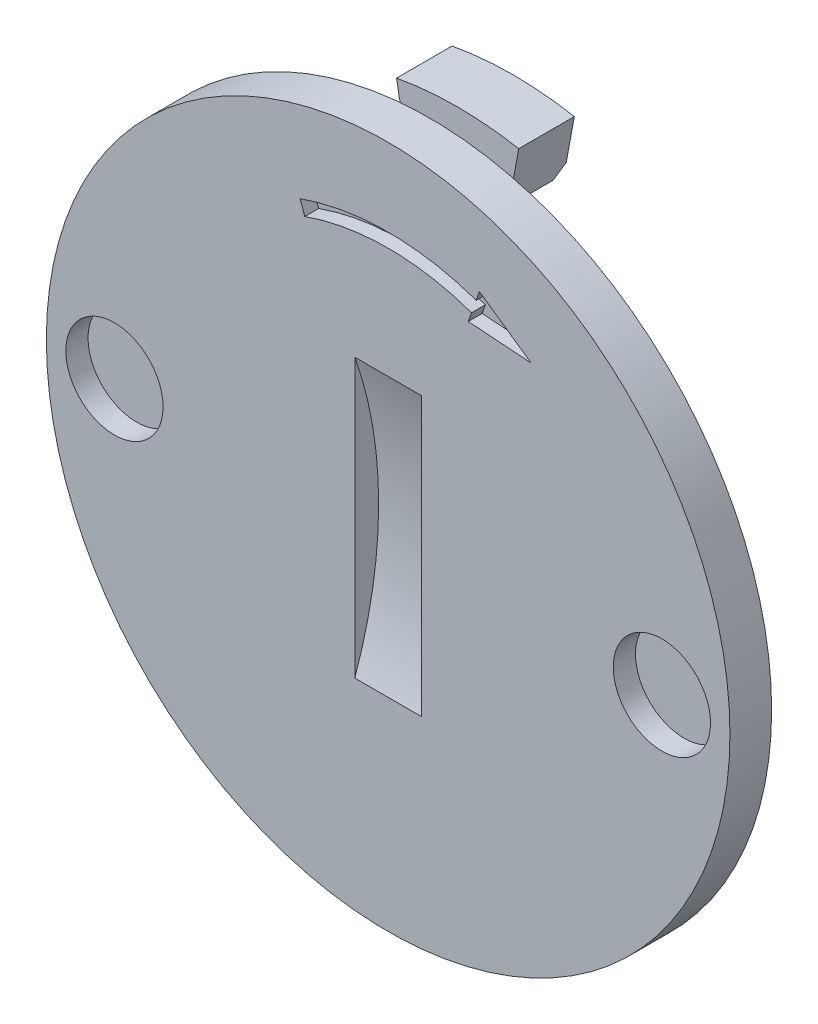
ISO-10303-21;
HEADER;
FILE_DESCRIPTION(('STEP AP214'),'2;1');
FILE_NAME('part.step','',(''),(''),'','','');
FILE_SCHEMA(('AUTOMOTIVE_DESIGN { 1 0 10303 214 1 1 1 1 }'));
ENDSEC;
DATA;
#1=APPLICATION_CONTEXT('core data for automotive mechanical design processes');
#2=APPLICATION_PROTOCOL_DEFINITION('international standard','automotive_design',2000,#1);
#3=PRODUCT_CONTEXT('',#1,'mechanical');
#4=PRODUCT('Part','Part','',(#3));
#5=PRODUCT_RELATED_PRODUCT_CATEGORY('part','',(#4));
#6=PRODUCT_DEFINITION_FORMATION('','',#4);
#7=PRODUCT_DEFINITION_CONTEXT('part definition',#1,'design');
#8=PRODUCT_DEFINITION('design','',#6,#7);
#9=PRODUCT_DEFINITION_SHAPE('','',#8);
#10=(LENGTH_UNIT() NAMED_UNIT(*) SI_UNIT(.MILLI.,.METRE.));
#11=(NAMED_UNIT(*) PLANE_ANGLE_UNIT() SI_UNIT($,.RADIAN.));
#12=(NAMED_UNIT(*) SI_UNIT($,.STERADIAN.) SOLID_ANGLE_UNIT());
#13=UNCERTAINTY_MEASURE_WITH_UNIT(LENGTH_MEASURE(1.E-05),#10,'distance_accuracy_value','');
#14=(GEOMETRIC_REPRESENTATION_CONTEXT(3) GLOBAL_UNCERTAINTY_ASSIGNED_CONTEXT((#13)) GLOBAL_UNIT_ASSIGNED_CONTEXT((#10,
#11,#12)) REPRESENTATION_CONTEXT('',''));
#15=CARTESIAN_POINT('',(0.,0.,0.));
#16=DIRECTION('',(0.,0.,1.));
#17=DIRECTION('',(1.,0.,0.));
#18=AXIS2_PLACEMENT_3D('',#15,#16,#17);
#19=CARTESIAN_POINT('',(0.,0.,-3.));
#20=DIRECTION('',(0.,0.,1.));
#21=DIRECTION('',(1.,0.,0.));
#22=AXIS2_PLACEMENT_3D('',#19,#20,#21);
#23=CYLINDRICAL_SURFACE('',#22,11.05);
#24=DIRECTION('',(0.,0.,1.));
#25=VECTOR('',#24,1.);
#26=CARTESIAN_POINT('',(-2.,-10.867497412008,-3.));
#27=LINE('',#26,#25);
#28=CARTESIAN_POINT('',(-2.,-10.867497412008,-1.));
#29=VERTEX_POINT('',#28);
#30=CARTESIAN_POINT('',(-2.,-10.867497412008,0.));
#31=VERTEX_POINT('',#30);
#32=EDGE_CURVE('E308',#29,#31,#27,.T.);
#33=ORIENTED_EDGE('',*,*,#32,.F.);
#34=CARTESIAN_POINT('',(0.,0.,-1.));
#35=DIRECTION('',(0.,0.,1.));
#36=DIRECTION('',(1.,0.,0.));
#37=AXIS2_PLACEMENT_3D('',#34,#35,#36);
#38=CIRCLE('',#37,11.05);
#39=CARTESIAN_POINT('',(2.,-10.867497412008,-1.));
#40=VERTEX_POINT('',#39);
#41=EDGE_CURVE('E255',#29,#40,#38,.T.);
#42=ORIENTED_EDGE('',*,*,#41,.T.);
#43=DIRECTION('',(0.,0.,1.));
#44=VECTOR('',#43,1.);
#45=CARTESIAN_POINT('',(2.,-10.867497412008,-3.));
#46=LINE('',#45,#44);
#47=CARTESIAN_POINT('',(2.,-10.867497412008,0.));
#48=VERTEX_POINT('',#47);
#49=EDGE_CURVE('E306',#40,#48,#46,.T.);
#50=ORIENTED_EDGE('',*,*,#49,.T.);
#51=CARTESIAN_POINT('',(0.,0.,0.));
#52=DIRECTION('',(0.,0.,1.));
#53=DIRECTION('',(-1.,0.,0.));
#54=AXIS2_PLACEMENT_3D('',#51,#52,#53);
#55=CIRCLE('',#54,11.05);
#56=EDGE_CURVE('E298',#31,#48,#55,.T.);
#57=ORIENTED_EDGE('',*,*,#56,.F.);
#58=EDGE_LOOP('',(#33,#42,#50,#57));
#59=FACE_BOUND('',#58,.T.);
#60=ADVANCED_FACE('F37',(#59),#23,.T.);
#61=CARTESIAN_POINT('',(0.,0.,0.));
#62=DIRECTION('',(0.,0.,1.));
#63=DIRECTION('',(1.,0.,0.));
#64=AXIS2_PLACEMENT_3D('',#61,#62,#63);
#65=PLANE('',#64);
#66=CARTESIAN_POINT('',(0.,0.,0.));
#67=DIRECTION('',(0.,0.,1.));
#68=DIRECTION('',(1.,0.,0.));
#69=AXIS2_PLACEMENT_3D('',#66,#67,#68);
#70=CIRCLE('',#69,10.15);
#71=CARTESIAN_POINT('',(1.83710407239819,9.98236187618832,0.));
#72=VERTEX_POINT('',#71);
#73=CARTESIAN_POINT('',(-1.83710407239819,9.98236187618832,0.));
#74=VERTEX_POINT('',#73);
#75=EDGE_CURVE('E314',#72,#74,#70,.T.);
#76=ORIENTED_EDGE('',*,*,#75,.F.);
#77=DIRECTION('',(-0.180995475113122,-0.983483928688504,0.));
#78=VECTOR('',#77,1.);
#79=CARTESIAN_POINT('',(0.,0.,0.));
#80=LINE('',#79,#78);
#81=CARTESIAN_POINT('',(2.,10.867497412008,0.));
#82=VERTEX_POINT('',#81);
#83=EDGE_CURVE('E339',#82,#72,#80,.T.);
#84=ORIENTED_EDGE('',*,*,#83,.F.);
#85=CARTESIAN_POINT('',(0.,0.,0.));
#86=DIRECTION('',(0.,0.,1.));
#87=DIRECTION('',(1.,0.,0.));
#88=AXIS2_PLACEMENT_3D('',#85,#86,#87);
#89=CIRCLE('',#88,11.05);
#90=CARTESIAN_POINT('',(-2.,10.867497412008,0.));
#91=VERTEX_POINT('',#90);
#92=EDGE_CURVE('E342',#82,#91,#89,.T.);
#93=ORIENTED_EDGE('',*,*,#92,.T.);
#94=DIRECTION('',(0.180995475113121,-0.983483928688505,0.));
#95=VECTOR('',#94,1.);
#96=CARTESIAN_POINT('',(0.,0.,0.));
#97=LINE('',#96,#95);
#98=EDGE_CURVE('E333',#91,#74,#97,.T.);
#99=ORIENTED_EDGE('',*,*,#98,.T.);
#100=EDGE_LOOP('',(#76,#84,#93,#99));
#101=FACE_BOUND('',#100,.T.);
#102=CARTESIAN_POINT('',(0.,0.,0.));
#103=DIRECTION('',(0.,0.,1.));
#104=DIRECTION('',(1.,0.,0.));
#105=AXIS2_PLACEMENT_3D('',#102,#103,#104);
#106=CIRCLE('',#105,12.3);
#107=CARTESIAN_POINT('',(12.3,0.,0.));
#108=VERTEX_POINT('',#107);
#109=EDGE_CURVE('E358',#108,#108,#106,.T.);
#110=ORIENTED_EDGE('',*,*,#109,.F.);
#111=EDGE_LOOP('',(#110));
#112=FACE_BOUND('',#111,.T.);
#113=CARTESIAN_POINT('',(0.,0.,0.));
#114=DIRECTION('',(0.,0.,1.));
#115=DIRECTION('',(-1.,0.,0.));
#116=AXIS2_PLACEMENT_3D('',#113,#114,#115);
#117=CIRCLE('',#116,10.15);
#118=CARTESIAN_POINT('',(-1.83710407239819,-9.98236187618832,0.));
#119=VERTEX_POINT('',#118);
#120=CARTESIAN_POINT('',(1.83710407239819,-9.98236187618832,0.));
#121=VERTEX_POINT('',#120);
#122=EDGE_CURVE('E270',#119,#121,#117,.T.);
#123=ORIENTED_EDGE('',*,*,#122,.F.);
#124=DIRECTION('',(0.180995475113122,0.983483928688504,0.));
#125=VECTOR('',#124,1.);
#126=CARTESIAN_POINT('',(0.,0.,0.));
#127=LINE('',#126,#125);
#128=EDGE_CURVE('E295',#31,#119,#127,.T.);
#129=ORIENTED_EDGE('',*,*,#128,.F.);
#130=ORIENTED_EDGE('',*,*,#56,.T.);
#131=DIRECTION('',(-0.180995475113121,0.983483928688505,0.));
#132=VECTOR('',#131,1.);
#133=CARTESIAN_POINT('',(0.,0.,0.));
#134=LINE('',#133,#132);
#135=EDGE_CURVE('E289',#48,#121,#134,.T.);
#136=ORIENTED_EDGE('',*,*,#135,.T.);
#137=EDGE_LOOP('',(#123,#129,#130,#136));
#138=FACE_BOUND('',#137,.T.);
#139=ADVANCED_FACE('F417',(#101,#112,#138),#65,.F.);
#140=CARTESIAN_POINT('',(0.,0.,-3.));
#141=DIRECTION('',(0.,0.,1.));
#142=DIRECTION('',(1.,0.,0.));
#143=AXIS2_PLACEMENT_3D('',#140,#141,#142);
#144=CYLINDRICAL_SURFACE('',#143,11.05);
#145=DIRECTION('',(0.,0.,1.));
#146=VECTOR('',#145,1.);
#147=CARTESIAN_POINT('',(2.,10.867497412008,-3.));
#148=LINE('',#147,#146);
#149=CARTESIAN_POINT('',(2.,10.867497412008,-1.));
#150=VERTEX_POINT('',#149);
#151=EDGE_CURVE('E352',#150,#82,#148,.T.);
#152=ORIENTED_EDGE('',*,*,#151,.F.);
#153=CARTESIAN_POINT('',(0.,0.,-1.));
#154=DIRECTION('',(0.,0.,1.));
#155=DIRECTION('',(-1.,0.,0.));
#156=AXIS2_PLACEMENT_3D('',#153,#154,#155);
#157=CIRCLE('',#156,11.05);
#158=CARTESIAN_POINT('',(-2.,10.867497412008,-1.));
#159=VERTEX_POINT('',#158);
#160=EDGE_CURVE('E305',#150,#159,#157,.T.);
#161=ORIENTED_EDGE('',*,*,#160,.T.);
#162=DIRECTION('',(0.,0.,1.));
#163=VECTOR('',#162,1.);
#164=CARTESIAN_POINT('',(-2.,10.867497412008,-3.));
#165=LINE('',#164,#163);
#166=EDGE_CURVE('E350',#159,#91,#165,.T.);
#167=ORIENTED_EDGE('',*,*,#166,.T.);
#168=ORIENTED_EDGE('',*,*,#92,.F.);
#169=EDGE_LOOP('',(#152,#161,#167,#168));
#170=FACE_BOUND('',#169,.T.);
#171=ADVANCED_FACE('F419',(#170),#144,.T.);
#172=CARTESIAN_POINT('',(0.,0.,1.5));
#173=DIRECTION('',(0.,0.,-1.));
#174=DIRECTION('',(-1.,0.,0.));
#175=AXIS2_PLACEMENT_3D('',#172,#173,#174);
#176=CYLINDRICAL_SURFACE('',#175,12.3);
#177=CARTESIAN_POINT('',(0.,0.,1.5));
#178=DIRECTION('',(0.,0.,1.));
#179=DIRECTION('',(1.,0.,0.));
#180=AXIS2_PLACEMENT_3D('',#177,#178,#179);
#181=CIRCLE('',#180,12.3);
#182=CARTESIAN_POINT('',(12.3,0.,1.5));
#183=VERTEX_POINT('',#182);
#184=EDGE_CURVE('E367',#183,#183,#181,.T.);
#185=ORIENTED_EDGE('',*,*,#184,.F.);
#186=EDGE_LOOP('',(#185));
#187=FACE_BOUND('',#186,.T.);
#188=ORIENTED_EDGE('',*,*,#109,.T.);
#189=EDGE_LOOP('',(#188));
#190=FACE_BOUND('',#189,.T.);
#191=ADVANCED_FACE('F426',(#187,#190),#176,.T.);
#192=CARTESIAN_POINT('',(0.,0.,1.5));
#193=DIRECTION('',(0.,0.,1.));
#194=DIRECTION('',(1.,0.,0.));
#195=AXIS2_PLACEMENT_3D('',#192,#193,#194);
#196=PLANE('',#195);
#197=DIRECTION('',(0.,-1.,0.));
#198=VECTOR('',#197,1.);
#199=CARTESIAN_POINT('',(1.2,5.,1.5));
#200=LINE('',#199,#198);
#201=CARTESIAN_POINT('',(1.2,5.,1.5));
#202=VERTEX_POINT('',#201);
#203=CARTESIAN_POINT('',(1.2,-5.,1.5));
#204=VERTEX_POINT('',#203);
#205=EDGE_CURVE('E206',#202,#204,#200,.T.);
#206=ORIENTED_EDGE('',*,*,#205,.T.);
#207=DIRECTION('',(-1.,0.,0.));
#208=VECTOR('',#207,1.);
#209=CARTESIAN_POINT('',(1.2,-5.,1.5));
#210=LINE('',#209,#208);
#211=CARTESIAN_POINT('',(-1.2,-5.,1.5));
#212=VERTEX_POINT('',#211);
#213=EDGE_CURVE('E192',#204,#212,#210,.T.);
#214=ORIENTED_EDGE('',*,*,#213,.T.);
#215=DIRECTION('',(0.,-1.,0.));
#216=VECTOR('',#215,1.);
#217=CARTESIAN_POINT('',(-1.2,5.,1.5));
#218=LINE('',#217,#216);
#219=CARTESIAN_POINT('',(-1.2,5.00000000000001,1.5));
#220=VERTEX_POINT('',#219);
#221=EDGE_CURVE('E197',#220,#212,#218,.T.);
#222=ORIENTED_EDGE('',*,*,#221,.F.);
#223=DIRECTION('',(-1.,0.,0.));
#224=VECTOR('',#223,1.);
#225=CARTESIAN_POINT('',(1.2,5.,1.5));
#226=LINE('',#225,#224);
#227=EDGE_CURVE('E195',#202,#220,#226,.T.);
#228=ORIENTED_EDGE('',*,*,#227,.F.);
#229=EDGE_LOOP('',(#206,#214,#222,#228));
#230=FACE_BOUND('',#229,.T.);
#231=CARTESIAN_POINT('',(0.,0.,1.5));
#232=DIRECTION('',(0.,0.,1.));
#233=DIRECTION('',(1.,0.,0.));
#234=AXIS2_PLACEMENT_3D('',#231,#232,#233);
#235=CIRCLE('',#234,9.5);
#236=CARTESIAN_POINT('',(3.16666666666667,8.9566858950296,1.5));
#237=VERTEX_POINT('',#236);
#238=CARTESIAN_POINT('',(-3.16666666666667,8.9566858950296,1.5));
#239=VERTEX_POINT('',#238);
#240=EDGE_CURVE('E59',#237,#239,#235,.T.);
#241=ORIENTED_EDGE('',*,*,#240,.F.);
#242=DIRECTION('',(-0.333333333333347,-0.942809041582059,0.));
#243=VECTOR('',#242,1.);
#244=CARTESIAN_POINT('',(3.16666666666667,8.9566858950296,1.5));
#245=LINE('',#244,#243);
#246=CARTESIAN_POINT('',(3.28333333333334,9.28666905958332,1.5));
#247=VERTEX_POINT('',#246);
#248=EDGE_CURVE('E216',#247,#237,#245,.T.);
#249=ORIENTED_EDGE('',*,*,#248,.F.);
#250=DIRECTION('',(-0.820938752401202,0.571016256166108,0.));
#251=VECTOR('',#250,1.);
#252=CARTESIAN_POINT('',(3.28333333333334,9.28666905958332,1.5));
#253=LINE('',#252,#251);
#254=CARTESIAN_POINT('',(5.1440775354765,7.99240053482094,1.5));
#255=VERTEX_POINT('',#254);
#256=EDGE_CURVE('E248',#255,#247,#253,.T.);
#257=ORIENTED_EDGE('',*,*,#256,.F.);
#258=DIRECTION('',(0.997414111336765,-0.0718685641034427,0.));
#259=VECTOR('',#258,1.);
#260=CARTESIAN_POINT('',(5.1440775354765,7.99240053482094,1.5));
#261=LINE('',#260,#259);
#262=CARTESIAN_POINT('',(2.88333333333334,8.15529820968485,1.5));
#263=VERTEX_POINT('',#262);
#264=EDGE_CURVE('E245',#263,#255,#261,.T.);
#265=ORIENTED_EDGE('',*,*,#264,.F.);
#266=DIRECTION('',(-0.333333333333322,-0.942809041582067,0.));
#267=VECTOR('',#266,1.);
#268=CARTESIAN_POINT('',(2.88333333333334,8.15529820968485,1.5));
#269=LINE('',#268,#267);
#270=CARTESIAN_POINT('',(3.,8.48528137423857,1.5));
#271=VERTEX_POINT('',#270);
#272=EDGE_CURVE('E242',#271,#263,#269,.T.);
#273=ORIENTED_EDGE('',*,*,#272,.F.);
#274=CARTESIAN_POINT('',(0.,0.,1.5));
#275=DIRECTION('',(0.,0.,-1.));
#276=DIRECTION('',(1.,0.,0.));
#277=AXIS2_PLACEMENT_3D('',#274,#275,#276);
#278=CIRCLE('',#277,9.);
#279=CARTESIAN_POINT('',(-3.,8.48528137423857,1.5));
#280=VERTEX_POINT('',#279);
#281=EDGE_CURVE('E239',#280,#271,#278,.T.);
#282=ORIENTED_EDGE('',*,*,#281,.F.);
#283=DIRECTION('',(0.333333333333333,-0.942809041582063,0.));
#284=VECTOR('',#283,1.);
#285=CARTESIAN_POINT('',(-3.16666666666667,8.9566858950296,1.5));
#286=LINE('',#285,#284);
#287=EDGE_CURVE('E236',#239,#280,#286,.T.);
#288=ORIENTED_EDGE('',*,*,#287,.F.);
#289=EDGE_LOOP('',(#241,#249,#257,#265,#273,#282,#288));
#290=FACE_BOUND('',#289,.T.);
#291=CARTESIAN_POINT('',(-9.85,0.,1.5));
#292=DIRECTION('',(0.,0.,1.));
#293=DIRECTION('',(1.,0.,0.));
#294=AXIS2_PLACEMENT_3D('',#291,#292,#293);
#295=CIRCLE('',#294,1.75);
#296=CARTESIAN_POINT('',(-8.1,0.,1.5));
#297=VERTEX_POINT('',#296);
#298=EDGE_CURVE('E359',#297,#297,#295,.T.);
#299=ORIENTED_EDGE('',*,*,#298,.F.);
#300=EDGE_LOOP('',(#299));
#301=FACE_BOUND('',#300,.T.);
#302=CARTESIAN_POINT('',(9.85,0.,1.5));
#303=DIRECTION('',(0.,0.,1.));
#304=DIRECTION('',(1.,0.,0.));
#305=AXIS2_PLACEMENT_3D('',#302,#303,#304);
#306=CIRCLE('',#305,1.75);
#307=CARTESIAN_POINT('',(11.6,0.,1.5));
#308=VERTEX_POINT('',#307);
#309=EDGE_CURVE('E349',#308,#308,#306,.T.);
#310=ORIENTED_EDGE('',*,*,#309,.F.);
#311=EDGE_LOOP('',(#310));
#312=FACE_BOUND('',#311,.T.);
#313=ORIENTED_EDGE('',*,*,#184,.T.);
#314=EDGE_LOOP('',(#313));
#315=FACE_BOUND('',#314,.T.);
#316=ADVANCED_FACE('F204',(#230,#290,#301,#312,#315),#196,.T.);
#317=CARTESIAN_POINT('',(9.85,0.,0.7));
#318=DIRECTION('',(0.,0.,1.));
#319=DIRECTION('',(1.,0.,0.));
#320=AXIS2_PLACEMENT_3D('',#317,#318,#319);
#321=CYLINDRICAL_SURFACE('',#320,1.75);
#322=CARTESIAN_POINT('',(9.85,0.,0.7));
#323=DIRECTION('',(0.,0.,1.));
#324=DIRECTION('',(1.,0.,0.));
#325=AXIS2_PLACEMENT_3D('',#322,#323,#324);
#326=CIRCLE('',#325,1.75);
#327=CARTESIAN_POINT('',(11.6,0.,0.7));
#328=VERTEX_POINT('',#327);
#329=EDGE_CURVE('E362',#328,#328,#326,.T.);
#330=ORIENTED_EDGE('',*,*,#329,.F.);
#331=EDGE_LOOP('',(#330));
#332=FACE_BOUND('',#331,.T.);
#333=ORIENTED_EDGE('',*,*,#309,.T.);
#334=EDGE_LOOP('',(#333));
#335=FACE_BOUND('',#334,.T.);
#336=ADVANCED_FACE('F492',(#332,#335),#321,.F.);
#337=CARTESIAN_POINT('',(9.85,0.,0.7));
#338=DIRECTION('',(0.,0.,1.));
#339=DIRECTION('',(1.,0.,0.));
#340=AXIS2_PLACEMENT_3D('',#337,#338,#339);
#341=PLANE('',#340);
#342=ORIENTED_EDGE('',*,*,#329,.T.);
#343=EDGE_LOOP('',(#342));
#344=FACE_BOUND('',#343,.T.);
#345=ADVANCED_FACE('F489',(#344),#341,.T.);
#346=CARTESIAN_POINT('',(-9.85,0.,0.7));
#347=DIRECTION('',(0.,0.,1.));
#348=DIRECTION('',(1.,0.,0.));
#349=AXIS2_PLACEMENT_3D('',#346,#347,#348);
#350=CYLINDRICAL_SURFACE('',#349,1.75);
#351=CARTESIAN_POINT('',(-9.85,0.,0.7));
#352=DIRECTION('',(0.,0.,1.));
#353=DIRECTION('',(1.,0.,0.));
#354=AXIS2_PLACEMENT_3D('',#351,#352,#353);
#355=CIRCLE('',#354,1.75);
#356=CARTESIAN_POINT('',(-8.1,0.,0.7));
#357=VERTEX_POINT('',#356);
#358=EDGE_CURVE('E355',#357,#357,#355,.T.);
#359=ORIENTED_EDGE('',*,*,#358,.F.);
#360=EDGE_LOOP('',(#359));
#361=FACE_BOUND('',#360,.T.);
#362=ORIENTED_EDGE('',*,*,#298,.T.);
#363=EDGE_LOOP('',(#362));
#364=FACE_BOUND('',#363,.T.);
#365=ADVANCED_FACE('F482',(#361,#364),#350,.F.);
#366=CARTESIAN_POINT('',(-9.85,0.,0.7));
#367=DIRECTION('',(0.,0.,1.));
#368=DIRECTION('',(1.,0.,0.));
#369=AXIS2_PLACEMENT_3D('',#366,#367,#368);
#370=PLANE('',#369);
#371=ORIENTED_EDGE('',*,*,#358,.T.);
#372=EDGE_LOOP('',(#371));
#373=FACE_BOUND('',#372,.T.);
#374=ADVANCED_FACE('F475',(#373),#370,.T.);
#375=CARTESIAN_POINT('',(0.,0.,-3.));
#376=DIRECTION('',(0.,0.,1.));
#377=DIRECTION('',(1.,0.,0.));
#378=AXIS2_PLACEMENT_3D('',#375,#376,#377);
#379=CYLINDRICAL_SURFACE('',#378,10.15);
#380=DIRECTION('',(0.,0.,1.));
#381=VECTOR('',#380,1.);
#382=CARTESIAN_POINT('',(-1.83710407239819,9.98236187618832,-3.));
#383=LINE('',#382,#381);
#384=CARTESIAN_POINT('',(-1.83710407239819,9.98236187618832,-2.6));
#385=VERTEX_POINT('',#384);
#386=EDGE_CURVE('E347',#385,#74,#383,.T.);
#387=ORIENTED_EDGE('',*,*,#386,.F.);
#388=CARTESIAN_POINT('',(0.,0.,-2.6));
#389=DIRECTION('',(0.,0.,1.));
#390=DIRECTION('',(1.,0.,0.));
#391=AXIS2_PLACEMENT_3D('',#388,#389,#390);
#392=CIRCLE('',#391,10.15);
#393=CARTESIAN_POINT('',(1.83710407239819,9.98236187618832,-2.6));
#394=VERTEX_POINT('',#393);
#395=EDGE_CURVE('E377',#385,#394,#392,.F.);
#396=ORIENTED_EDGE('',*,*,#395,.T.);
#397=DIRECTION('',(0.,0.,1.));
#398=VECTOR('',#397,1.);
#399=CARTESIAN_POINT('',(1.83710407239819,9.98236187618832,-3.));
#400=LINE('',#399,#398);
#401=EDGE_CURVE('E336',#394,#72,#400,.T.);
#402=ORIENTED_EDGE('',*,*,#401,.T.);
#403=ORIENTED_EDGE('',*,*,#75,.T.);
#404=EDGE_LOOP('',(#387,#396,#402,#403));
#405=FACE_BOUND('',#404,.T.);
#406=ADVANCED_FACE('F473',(#405),#379,.F.);
#407=CARTESIAN_POINT('',(0.,0.,-3.));
#408=DIRECTION('',(-0.983483928688505,-0.180995475113121,0.));
#409=DIRECTION('',(0.180995475113121,-0.983483928688505,0.));
#410=AXIS2_PLACEMENT_3D('',#407,#408,#409);
#411=PLANE('',#410);
#412=DIRECTION('',(0.180995475113121,-0.983483928688505,0.));
#413=VECTOR('',#412,1.);
#414=CARTESIAN_POINT('',(0.,0.,-3.));
#415=LINE('',#414,#413);
#416=CARTESIAN_POINT('',(-2.19909502262443,11.9493297335653,-3.));
#417=VERTEX_POINT('',#416);
#418=CARTESIAN_POINT('',(-1.90950226244344,10.3757554476637,-3.));
#419=VERTEX_POINT('',#418);
#420=EDGE_CURVE('E332',#417,#419,#415,.T.);
#421=ORIENTED_EDGE('',*,*,#420,.T.);
#422=DIRECTION('',(-0.127983127816569,0.695428155163625,-0.707106781186551));
#423=VECTOR('',#422,1.);
#424=CARTESIAN_POINT('',(0.,0.,7.55000000000009));
#425=LINE('',#424,#423);
#426=EDGE_CURVE('E375',#419,#385,#425,.F.);
#427=ORIENTED_EDGE('',*,*,#426,.T.);
#428=ORIENTED_EDGE('',*,*,#386,.T.);
#429=ORIENTED_EDGE('',*,*,#98,.F.);
#430=ORIENTED_EDGE('',*,*,#166,.F.);
#431=DIRECTION('',(-0.180995475113121,0.983483928688505,0.));
#432=VECTOR('',#431,1.);
#433=CARTESIAN_POINT('',(-2.,10.867497412008,-1.));
#434=LINE('',#433,#432);
#435=CARTESIAN_POINT('',(-2.19909502262443,11.9493297335653,-1.));
#436=VERTEX_POINT('',#435);
#437=EDGE_CURVE('E317',#159,#436,#434,.T.);
#438=ORIENTED_EDGE('',*,*,#437,.T.);
#439=DIRECTION('',(0.,0.,1.));
#440=VECTOR('',#439,1.);
#441=CARTESIAN_POINT('',(-2.19909502262443,11.9493297335653,-7.58136317730132));
#442=LINE('',#441,#440);
#443=EDGE_CURVE('E315',#417,#436,#442,.T.);
#444=ORIENTED_EDGE('',*,*,#443,.F.);
#445=EDGE_LOOP('',(#421,#427,#428,#429,#430,#438,#444));
#446=FACE_BOUND('',#445,.T.);
#447=ADVANCED_FACE('F470',(#446),#411,.T.);
#448=CARTESIAN_POINT('',(0.,0.,-3.));
#449=DIRECTION('',(-0.983483928688504,0.180995475113122,0.));
#450=DIRECTION('',(-0.180995475113122,-0.983483928688504,0.));
#451=AXIS2_PLACEMENT_3D('',#448,#449,#450);
#452=PLANE('',#451);
#453=ORIENTED_EDGE('',*,*,#401,.F.);
#454=DIRECTION('',(0.127983127816569,0.695428155163625,-0.707106781186551));
#455=VECTOR('',#454,1.);
#456=CARTESIAN_POINT('',(0.,0.,7.55000000000009));
#457=LINE('',#456,#455);
#458=CARTESIAN_POINT('',(1.90950226244344,10.3757554476637,-3.));
#459=VERTEX_POINT('',#458);
#460=EDGE_CURVE('E379',#394,#459,#457,.T.);
#461=ORIENTED_EDGE('',*,*,#460,.T.);
#462=DIRECTION('',(-0.180995475113122,-0.983483928688504,0.));
#463=VECTOR('',#462,1.);
#464=CARTESIAN_POINT('',(0.,0.,-3.));
#465=LINE('',#464,#463);
#466=CARTESIAN_POINT('',(2.19909502262444,11.9493297335653,-3.));
#467=VERTEX_POINT('',#466);
#468=EDGE_CURVE('E329',#467,#459,#465,.T.);
#469=ORIENTED_EDGE('',*,*,#468,.F.);
#470=DIRECTION('',(0.,0.,1.));
#471=VECTOR('',#470,1.);
#472=CARTESIAN_POINT('',(2.19909502262444,11.9493297335653,-7.58136317730132));
#473=LINE('',#472,#471);
#474=CARTESIAN_POINT('',(2.19909502262444,11.9493297335653,-1.));
#475=VERTEX_POINT('',#474);
#476=EDGE_CURVE('E326',#467,#475,#473,.T.);
#477=ORIENTED_EDGE('',*,*,#476,.T.);
#478=DIRECTION('',(-0.180995475113122,-0.983483928688504,0.));
#479=VECTOR('',#478,1.);
#480=CARTESIAN_POINT('',(2.,10.867497412008,-1.));
#481=LINE('',#480,#479);
#482=EDGE_CURVE('E323',#475,#150,#481,.T.);
#483=ORIENTED_EDGE('',*,*,#482,.T.);
#484=ORIENTED_EDGE('',*,*,#151,.T.);
#485=ORIENTED_EDGE('',*,*,#83,.T.);
#486=EDGE_LOOP('',(#453,#461,#469,#477,#483,#484,#485));
#487=FACE_BOUND('',#486,.T.);
#488=ADVANCED_FACE('F454',(#487),#452,.F.);
#489=CARTESIAN_POINT('',(0.,0.,-3.));
#490=DIRECTION('',(0.,0.,1.));
#491=DIRECTION('',(1.,0.,0.));
#492=AXIS2_PLACEMENT_3D('',#489,#490,#491);
#493=PLANE('',#492);
#494=ORIENTED_EDGE('',*,*,#468,.T.);
#495=CARTESIAN_POINT('',(0.,0.,-3.));
#496=DIRECTION('',(0.,0.,1.));
#497=DIRECTION('',(1.,0.,0.));
#498=AXIS2_PLACEMENT_3D('',#495,#496,#497);
#499=CIRCLE('',#498,10.55);
#500=EDGE_CURVE('E370',#459,#419,#499,.T.);
#501=ORIENTED_EDGE('',*,*,#500,.T.);
#502=ORIENTED_EDGE('',*,*,#420,.F.);
#503=CARTESIAN_POINT('',(0.,0.,-3.));
#504=DIRECTION('',(0.,0.,1.));
#505=DIRECTION('',(1.,0.,0.));
#506=AXIS2_PLACEMENT_3D('',#503,#504,#505);
#507=CIRCLE('',#506,12.15);
#508=EDGE_CURVE('E311',#467,#417,#507,.T.);
#509=ORIENTED_EDGE('',*,*,#508,.F.);
#510=EDGE_LOOP('',(#494,#501,#502,#509));
#511=FACE_BOUND('',#510,.T.);
#512=ADVANCED_FACE('F457',(#511),#493,.F.);
#513=CARTESIAN_POINT('',(0.,0.,-1.));
#514=DIRECTION('',(0.,0.,-1.));
#515=DIRECTION('',(-1.,0.,0.));
#516=AXIS2_PLACEMENT_3D('',#513,#514,#515);
#517=PLANE('',#516);
#518=ORIENTED_EDGE('',*,*,#160,.F.);
#519=ORIENTED_EDGE('',*,*,#482,.F.);
#520=CARTESIAN_POINT('',(0.,0.,-1.));
#521=DIRECTION('',(0.,0.,-1.));
#522=DIRECTION('',(-1.,0.,0.));
#523=AXIS2_PLACEMENT_3D('',#520,#521,#522);
#524=CIRCLE('',#523,12.15);
#525=EDGE_CURVE('E320',#436,#475,#524,.T.);
#526=ORIENTED_EDGE('',*,*,#525,.F.);
#527=ORIENTED_EDGE('',*,*,#437,.F.);
#528=EDGE_LOOP('',(#518,#519,#526,#527));
#529=FACE_BOUND('',#528,.T.);
#530=ADVANCED_FACE('F446',(#529),#517,.F.);
#531=CARTESIAN_POINT('',(0.,0.,-7.58136317730132));
#532=DIRECTION('',(0.,0.,1.));
#533=DIRECTION('',(1.,0.,0.));
#534=AXIS2_PLACEMENT_3D('',#531,#532,#533);
#535=CYLINDRICAL_SURFACE('',#534,12.15);
#536=ORIENTED_EDGE('',*,*,#476,.F.);
#537=ORIENTED_EDGE('',*,*,#508,.T.);
#538=ORIENTED_EDGE('',*,*,#443,.T.);
#539=ORIENTED_EDGE('',*,*,#525,.T.);
#540=EDGE_LOOP('',(#536,#537,#538,#539));
#541=FACE_BOUND('',#540,.T.);
#542=ADVANCED_FACE('F439',(#541),#535,.T.);
#543=CARTESIAN_POINT('',(0.,0.,-3.));
#544=DIRECTION('',(0.,0.,-1.));
#545=DIRECTION('',(-1.,0.,0.));
#546=AXIS2_PLACEMENT_3D('',#543,#544,#545);
#547=CONICAL_SURFACE('',#546,10.55,0.785398163397444);
#548=ORIENTED_EDGE('',*,*,#460,.F.);
#549=ORIENTED_EDGE('',*,*,#395,.F.);
#550=ORIENTED_EDGE('',*,*,#426,.F.);
#551=ORIENTED_EDGE('',*,*,#500,.F.);
#552=EDGE_LOOP('',(#548,#549,#550,#551));
#553=FACE_BOUND('',#552,.T.);
#554=ADVANCED_FACE('F437',(#553),#547,.F.);
#555=CARTESIAN_POINT('',(0.,0.,-3.));
#556=DIRECTION('',(0.,0.,1.));
#557=DIRECTION('',(1.,0.,0.));
#558=AXIS2_PLACEMENT_3D('',#555,#556,#557);
#559=CYLINDRICAL_SURFACE('',#558,10.15);
#560=DIRECTION('',(0.,0.,1.));
#561=VECTOR('',#560,1.);
#562=CARTESIAN_POINT('',(1.83710407239819,-9.98236187618832,-3.));
#563=LINE('',#562,#561);
#564=CARTESIAN_POINT('',(1.83710407239819,-9.98236187618832,-2.6));
#565=VERTEX_POINT('',#564);
#566=EDGE_CURVE('E303',#565,#121,#563,.T.);
#567=ORIENTED_EDGE('',*,*,#566,.F.);
#568=CARTESIAN_POINT('',(0.,0.,-2.6));
#569=DIRECTION('',(0.,0.,1.));
#570=DIRECTION('',(1.,0.,0.));
#571=AXIS2_PLACEMENT_3D('',#568,#569,#570);
#572=CIRCLE('',#571,10.15);
#573=CARTESIAN_POINT('',(-1.83710407239819,-9.98236187618832,-2.6));
#574=VERTEX_POINT('',#573);
#575=EDGE_CURVE('E45',#565,#574,#572,.F.);
#576=ORIENTED_EDGE('',*,*,#575,.T.);
#577=DIRECTION('',(0.,0.,1.));
#578=VECTOR('',#577,1.);
#579=CARTESIAN_POINT('',(-1.83710407239819,-9.98236187618832,-3.));
#580=LINE('',#579,#578);
#581=EDGE_CURVE('E292',#574,#119,#580,.T.);
#582=ORIENTED_EDGE('',*,*,#581,.T.);
#583=ORIENTED_EDGE('',*,*,#122,.T.);
#584=EDGE_LOOP('',(#567,#576,#582,#583));
#585=FACE_BOUND('',#584,.T.);
#586=ADVANCED_FACE('F389',(#585),#559,.F.);
#587=CARTESIAN_POINT('',(0.,0.,-3.));
#588=DIRECTION('',(0.983483928688505,0.180995475113121,0.));
#589=DIRECTION('',(-0.180995475113121,0.983483928688505,0.));
#590=AXIS2_PLACEMENT_3D('',#587,#588,#589);
#591=PLANE('',#590);
#592=DIRECTION('',(-0.180995475113121,0.983483928688505,0.));
#593=VECTOR('',#592,1.);
#594=CARTESIAN_POINT('',(0.,0.,-3.));
#595=LINE('',#594,#593);
#596=CARTESIAN_POINT('',(2.19909502262443,-11.9493297335653,-3.));
#597=VERTEX_POINT('',#596);
#598=CARTESIAN_POINT('',(1.90950226244344,-10.3757554476637,-3.));
#599=VERTEX_POINT('',#598);
#600=EDGE_CURVE('E288',#597,#599,#595,.T.);
#601=ORIENTED_EDGE('',*,*,#600,.T.);
#602=DIRECTION('',(0.127983127816569,-0.695428155163625,-0.707106781186551));
#603=VECTOR('',#602,1.);
#604=CARTESIAN_POINT('',(0.,0.,7.55000000000009));
#605=LINE('',#604,#603);
#606=EDGE_CURVE('E384',#599,#565,#605,.F.);
#607=ORIENTED_EDGE('',*,*,#606,.T.);
#608=ORIENTED_EDGE('',*,*,#566,.T.);
#609=ORIENTED_EDGE('',*,*,#135,.F.);
#610=ORIENTED_EDGE('',*,*,#49,.F.);
#611=DIRECTION('',(0.180995475113121,-0.983483928688505,0.));
#612=VECTOR('',#611,1.);
#613=CARTESIAN_POINT('',(2.,-10.867497412008,-1.));
#614=LINE('',#613,#612);
#615=CARTESIAN_POINT('',(2.19909502262443,-11.9493297335653,-1.));
#616=VERTEX_POINT('',#615);
#617=EDGE_CURVE('E273',#40,#616,#614,.T.);
#618=ORIENTED_EDGE('',*,*,#617,.T.);
#619=DIRECTION('',(0.,0.,1.));
#620=VECTOR('',#619,1.);
#621=CARTESIAN_POINT('',(2.19909502262443,-11.9493297335653,-7.58136317730132));
#622=LINE('',#621,#620);
#623=EDGE_CURVE('E271',#597,#616,#622,.T.);
#624=ORIENTED_EDGE('',*,*,#623,.F.);
#625=EDGE_LOOP('',(#601,#607,#608,#609,#610,#618,#624));
#626=FACE_BOUND('',#625,.T.);
#627=ADVANCED_FACE('F402',(#626),#591,.T.);
#628=CARTESIAN_POINT('',(0.,0.,-3.));
#629=DIRECTION('',(0.983483928688504,-0.180995475113122,0.));
#630=DIRECTION('',(0.180995475113122,0.983483928688504,0.));
#631=AXIS2_PLACEMENT_3D('',#628,#629,#630);
#632=PLANE('',#631);
#633=ORIENTED_EDGE('',*,*,#581,.F.);
#634=DIRECTION('',(-0.127983127816569,-0.695428155163625,-0.707106781186551));
#635=VECTOR('',#634,1.);
#636=CARTESIAN_POINT('',(0.,0.,7.55000000000009));
#637=LINE('',#636,#635);
#638=CARTESIAN_POINT('',(-1.90950226244344,-10.3757554476637,-3.));
#639=VERTEX_POINT('',#638);
#640=EDGE_CURVE('E11',#574,#639,#637,.T.);
#641=ORIENTED_EDGE('',*,*,#640,.T.);
#642=DIRECTION('',(0.180995475113122,0.983483928688504,0.));
#643=VECTOR('',#642,1.);
#644=CARTESIAN_POINT('',(0.,0.,-3.));
#645=LINE('',#644,#643);
#646=CARTESIAN_POINT('',(-2.19909502262444,-11.9493297335653,-3.));
#647=VERTEX_POINT('',#646);
#648=EDGE_CURVE('E285',#647,#639,#645,.T.);
#649=ORIENTED_EDGE('',*,*,#648,.F.);
#650=DIRECTION('',(0.,0.,1.));
#651=VECTOR('',#650,1.);
#652=CARTESIAN_POINT('',(-2.19909502262444,-11.9493297335653,-7.58136317730132));
#653=LINE('',#652,#651);
#654=CARTESIAN_POINT('',(-2.19909502262444,-11.9493297335653,-1.));
#655=VERTEX_POINT('',#654);
#656=EDGE_CURVE('E282',#647,#655,#653,.T.);
#657=ORIENTED_EDGE('',*,*,#656,.T.);
#658=DIRECTION('',(0.180995475113122,0.983483928688504,0.));
#659=VECTOR('',#658,1.);
#660=CARTESIAN_POINT('',(-2.,-10.867497412008,-1.));
#661=LINE('',#660,#659);
#662=EDGE_CURVE('E279',#655,#29,#661,.T.);
#663=ORIENTED_EDGE('',*,*,#662,.T.);
#664=ORIENTED_EDGE('',*,*,#32,.T.);
#665=ORIENTED_EDGE('',*,*,#128,.T.);
#666=EDGE_LOOP('',(#633,#641,#649,#657,#663,#664,#665));
#667=FACE_BOUND('',#666,.T.);
#668=ADVANCED_FACE('F394',(#667),#632,.F.);
#669=CARTESIAN_POINT('',(0.,0.,-3.));
#670=DIRECTION('',(0.,0.,1.));
#671=DIRECTION('',(-1.,0.,0.));
#672=AXIS2_PLACEMENT_3D('',#669,#670,#671);
#673=PLANE('',#672);
#674=ORIENTED_EDGE('',*,*,#648,.T.);
#675=CARTESIAN_POINT('',(0.,0.,-3.));
#676=DIRECTION('',(0.,0.,1.));
#677=DIRECTION('',(1.,0.,0.));
#678=AXIS2_PLACEMENT_3D('',#675,#676,#677);
#679=CIRCLE('',#678,10.55);
#680=EDGE_CURVE('E381',#639,#599,#679,.T.);
#681=ORIENTED_EDGE('',*,*,#680,.T.);
#682=ORIENTED_EDGE('',*,*,#600,.F.);
#683=CARTESIAN_POINT('',(0.,0.,-3.));
#684=DIRECTION('',(0.,0.,1.));
#685=DIRECTION('',(1.,0.,0.));
#686=AXIS2_PLACEMENT_3D('',#683,#684,#685);
#687=CIRCLE('',#686,12.15);
#688=EDGE_CURVE('E267',#647,#597,#687,.T.);
#689=ORIENTED_EDGE('',*,*,#688,.F.);
#690=EDGE_LOOP('',(#674,#681,#682,#689));
#691=FACE_BOUND('',#690,.T.);
#692=ADVANCED_FACE('F398',(#691),#673,.F.);
#693=CARTESIAN_POINT('',(0.,0.,-1.));
#694=DIRECTION('',(0.,0.,-1.));
#695=DIRECTION('',(1.,0.,0.));
#696=AXIS2_PLACEMENT_3D('',#693,#694,#695);
#697=PLANE('',#696);
#698=ORIENTED_EDGE('',*,*,#41,.F.);
#699=ORIENTED_EDGE('',*,*,#662,.F.);
#700=CARTESIAN_POINT('',(0.,0.,-1.));
#701=DIRECTION('',(0.,0.,-1.));
#702=DIRECTION('',(1.,0.,0.));
#703=AXIS2_PLACEMENT_3D('',#700,#701,#702);
#704=CIRCLE('',#703,12.15);
#705=EDGE_CURVE('E276',#616,#655,#704,.T.);
#706=ORIENTED_EDGE('',*,*,#705,.F.);
#707=ORIENTED_EDGE('',*,*,#617,.F.);
#708=EDGE_LOOP('',(#698,#699,#706,#707));
#709=FACE_BOUND('',#708,.T.);
#710=ADVANCED_FACE('F412',(#709),#697,.F.);
#711=CARTESIAN_POINT('',(0.,0.,-7.58136317730132));
#712=DIRECTION('',(0.,0.,1.));
#713=DIRECTION('',(1.,0.,0.));
#714=AXIS2_PLACEMENT_3D('',#711,#712,#713);
#715=CYLINDRICAL_SURFACE('',#714,12.15);
#716=ORIENTED_EDGE('',*,*,#656,.F.);
#717=ORIENTED_EDGE('',*,*,#688,.T.);
#718=ORIENTED_EDGE('',*,*,#623,.T.);
#719=ORIENTED_EDGE('',*,*,#705,.T.);
#720=EDGE_LOOP('',(#716,#717,#718,#719));
#721=FACE_BOUND('',#720,.T.);
#722=ADVANCED_FACE('F408',(#721),#715,.T.);
#723=CARTESIAN_POINT('',(0.,0.,-3.));
#724=DIRECTION('',(0.,0.,-1.));
#725=DIRECTION('',(-1.,0.,0.));
#726=AXIS2_PLACEMENT_3D('',#723,#724,#725);
#727=CONICAL_SURFACE('',#726,10.55,0.785398163397444);
#728=ORIENTED_EDGE('',*,*,#640,.F.);
#729=ORIENTED_EDGE('',*,*,#575,.F.);
#730=ORIENTED_EDGE('',*,*,#606,.F.);
#731=ORIENTED_EDGE('',*,*,#680,.F.);
#732=EDGE_LOOP('',(#728,#729,#730,#731));
#733=FACE_BOUND('',#732,.T.);
#734=ADVANCED_FACE('F39',(#733),#727,.F.);
#735=CARTESIAN_POINT('',(0.,0.,1.));
#736=DIRECTION('',(0.,0.,1.));
#737=DIRECTION('',(1.,0.,0.));
#738=AXIS2_PLACEMENT_3D('',#735,#736,#737);
#739=CYLINDRICAL_SURFACE('',#738,9.5);
#740=ORIENTED_EDGE('',*,*,#240,.T.);
#741=DIRECTION('',(0.,0.,1.));
#742=VECTOR('',#741,1.);
#743=CARTESIAN_POINT('',(-3.16666666666667,8.9566858950296,1.));
#744=LINE('',#743,#742);
#745=CARTESIAN_POINT('',(-3.16666666666667,8.9566858950296,1.));
#746=VERTEX_POINT('',#745);
#747=EDGE_CURVE('E234',#746,#239,#744,.T.);
#748=ORIENTED_EDGE('',*,*,#747,.F.);
#749=CARTESIAN_POINT('',(0.,0.,1.));
#750=DIRECTION('',(0.,0.,1.));
#751=DIRECTION('',(1.,0.,0.));
#752=AXIS2_PLACEMENT_3D('',#749,#750,#751);
#753=CIRCLE('',#752,9.5);
#754=CARTESIAN_POINT('',(3.16666666666667,8.9566858950296,1.));
#755=VERTEX_POINT('',#754);
#756=EDGE_CURVE('E212',#755,#746,#753,.T.);
#757=ORIENTED_EDGE('',*,*,#756,.F.);
#758=DIRECTION('',(0.,0.,1.));
#759=VECTOR('',#758,1.);
#760=CARTESIAN_POINT('',(3.16666666666667,8.9566858950296,1.));
#761=LINE('',#760,#759);
#762=EDGE_CURVE('E253',#755,#237,#761,.T.);
#763=ORIENTED_EDGE('',*,*,#762,.T.);
#764=EDGE_LOOP('',(#740,#748,#757,#763));
#765=FACE_BOUND('',#764,.T.);
#766=ADVANCED_FACE('F637',(#765),#739,.F.);
#767=CARTESIAN_POINT('',(3.16666666666667,8.9566858950296,1.));
#768=DIRECTION('',(-0.942809041582059,0.333333333333347,0.));
#769=DIRECTION('',(-0.333333333333347,-0.942809041582059,0.));
#770=AXIS2_PLACEMENT_3D('',#767,#768,#769);
#771=PLANE('',#770);
#772=ORIENTED_EDGE('',*,*,#248,.T.);
#773=ORIENTED_EDGE('',*,*,#762,.F.);
#774=DIRECTION('',(-0.333333333333347,-0.942809041582059,0.));
#775=VECTOR('',#774,1.);
#776=CARTESIAN_POINT('',(3.16666666666667,8.9566858950296,1.));
#777=LINE('',#776,#775);
#778=CARTESIAN_POINT('',(3.28333333333334,9.28666905958332,1.));
#779=VERTEX_POINT('',#778);
#780=EDGE_CURVE('E231',#779,#755,#777,.T.);
#781=ORIENTED_EDGE('',*,*,#780,.F.);
#782=DIRECTION('',(0.,0.,1.));
#783=VECTOR('',#782,1.);
#784=CARTESIAN_POINT('',(3.28333333333334,9.28666905958332,1.));
#785=LINE('',#784,#783);
#786=EDGE_CURVE('E256',#779,#247,#785,.T.);
#787=ORIENTED_EDGE('',*,*,#786,.T.);
#788=EDGE_LOOP('',(#772,#773,#781,#787));
#789=FACE_BOUND('',#788,.T.);
#790=ADVANCED_FACE('F645',(#789),#771,.F.);
#791=CARTESIAN_POINT('',(3.28333333333334,9.28666905958332,1.));
#792=DIRECTION('',(0.571016256166108,0.820938752401202,0.));
#793=DIRECTION('',(-0.820938752401202,0.571016256166108,0.));
#794=AXIS2_PLACEMENT_3D('',#791,#792,#793);
#795=PLANE('',#794);
#796=ORIENTED_EDGE('',*,*,#256,.T.);
#797=ORIENTED_EDGE('',*,*,#786,.F.);
#798=DIRECTION('',(-0.820938752401202,0.571016256166108,0.));
#799=VECTOR('',#798,1.);
#800=CARTESIAN_POINT('',(3.28333333333334,9.28666905958332,1.));
#801=LINE('',#800,#799);
#802=CARTESIAN_POINT('',(5.1440775354765,7.99240053482094,1.));
#803=VERTEX_POINT('',#802);
#804=EDGE_CURVE('E228',#803,#779,#801,.T.);
#805=ORIENTED_EDGE('',*,*,#804,.F.);
#806=DIRECTION('',(0.,0.,1.));
#807=VECTOR('',#806,1.);
#808=CARTESIAN_POINT('',(5.1440775354765,7.99240053482094,1.));
#809=LINE('',#808,#807);
#810=EDGE_CURVE('E258',#803,#255,#809,.T.);
#811=ORIENTED_EDGE('',*,*,#810,.T.);
#812=EDGE_LOOP('',(#796,#797,#805,#811));
#813=FACE_BOUND('',#812,.T.);
#814=ADVANCED_FACE('F654',(#813),#795,.F.);
#815=CARTESIAN_POINT('',(5.1440775354765,7.99240053482094,1.));
#816=DIRECTION('',(-0.0718685641034427,-0.997414111336765,0.));
#817=DIRECTION('',(0.997414111336765,-0.0718685641034427,0.));
#818=AXIS2_PLACEMENT_3D('',#815,#816,#817);
#819=PLANE('',#818);
#820=ORIENTED_EDGE('',*,*,#264,.T.);
#821=ORIENTED_EDGE('',*,*,#810,.F.);
#822=DIRECTION('',(0.997414111336765,-0.0718685641034427,0.));
#823=VECTOR('',#822,1.);
#824=CARTESIAN_POINT('',(5.1440775354765,7.99240053482094,1.));
#825=LINE('',#824,#823);
#826=CARTESIAN_POINT('',(2.88333333333334,8.15529820968485,1.));
#827=VERTEX_POINT('',#826);
#828=EDGE_CURVE('E225',#827,#803,#825,.T.);
#829=ORIENTED_EDGE('',*,*,#828,.F.);
#830=DIRECTION('',(0.,0.,1.));
#831=VECTOR('',#830,1.);
#832=CARTESIAN_POINT('',(2.88333333333334,8.15529820968485,1.));
#833=LINE('',#832,#831);
#834=EDGE_CURVE('E260',#827,#263,#833,.T.);
#835=ORIENTED_EDGE('',*,*,#834,.T.);
#836=EDGE_LOOP('',(#820,#821,#829,#835));
#837=FACE_BOUND('',#836,.T.);
#838=ADVANCED_FACE('F664',(#837),#819,.F.);
#839=CARTESIAN_POINT('',(2.88333333333334,8.15529820968485,1.));
#840=DIRECTION('',(-0.942809041582067,0.333333333333322,0.));
#841=DIRECTION('',(-0.333333333333322,-0.942809041582067,0.));
#842=AXIS2_PLACEMENT_3D('',#839,#840,#841);
#843=PLANE('',#842);
#844=ORIENTED_EDGE('',*,*,#272,.T.);
#845=ORIENTED_EDGE('',*,*,#834,.F.);
#846=DIRECTION('',(-0.333333333333322,-0.942809041582067,0.));
#847=VECTOR('',#846,1.);
#848=CARTESIAN_POINT('',(2.88333333333334,8.15529820968485,1.));
#849=LINE('',#848,#847);
#850=CARTESIAN_POINT('',(3.,8.48528137423857,1.));
#851=VERTEX_POINT('',#850);
#852=EDGE_CURVE('E222',#851,#827,#849,.T.);
#853=ORIENTED_EDGE('',*,*,#852,.F.);
#854=DIRECTION('',(0.,0.,1.));
#855=VECTOR('',#854,1.);
#856=CARTESIAN_POINT('',(3.,8.48528137423857,1.));
#857=LINE('',#856,#855);
#858=EDGE_CURVE('E262',#851,#271,#857,.T.);
#859=ORIENTED_EDGE('',*,*,#858,.T.);
#860=EDGE_LOOP('',(#844,#845,#853,#859));
#861=FACE_BOUND('',#860,.T.);
#862=ADVANCED_FACE('F674',(#861),#843,.F.);
#863=CARTESIAN_POINT('',(0.,0.,1.));
#864=DIRECTION('',(0.,0.,1.));
#865=DIRECTION('',(1.,0.,0.));
#866=AXIS2_PLACEMENT_3D('',#863,#864,#865);
#867=CYLINDRICAL_SURFACE('',#866,9.);
#868=ORIENTED_EDGE('',*,*,#281,.T.);
#869=ORIENTED_EDGE('',*,*,#858,.F.);
#870=CARTESIAN_POINT('',(0.,0.,1.));
#871=DIRECTION('',(0.,0.,-1.));
#872=DIRECTION('',(1.,0.,0.));
#873=AXIS2_PLACEMENT_3D('',#870,#871,#872);
#874=CIRCLE('',#873,9.);
#875=CARTESIAN_POINT('',(-3.,8.48528137423857,1.));
#876=VERTEX_POINT('',#875);
#877=EDGE_CURVE('E219',#876,#851,#874,.T.);
#878=ORIENTED_EDGE('',*,*,#877,.F.);
#879=DIRECTION('',(0.,0.,1.));
#880=VECTOR('',#879,1.);
#881=CARTESIAN_POINT('',(-3.,8.48528137423857,1.));
#882=LINE('',#881,#880);
#883=EDGE_CURVE('E264',#876,#280,#882,.T.);
#884=ORIENTED_EDGE('',*,*,#883,.T.);
#885=EDGE_LOOP('',(#868,#869,#878,#884));
#886=FACE_BOUND('',#885,.T.);
#887=ADVANCED_FACE('F684',(#886),#867,.T.);
#888=CARTESIAN_POINT('',(-3.16666666666667,8.9566858950296,1.));
#889=DIRECTION('',(-0.942809041582063,-0.333333333333333,0.));
#890=DIRECTION('',(0.333333333333334,-0.942809041582063,0.));
#891=AXIS2_PLACEMENT_3D('',#888,#889,#890);
#892=PLANE('',#891);
#893=ORIENTED_EDGE('',*,*,#287,.T.);
#894=ORIENTED_EDGE('',*,*,#883,.F.);
#895=DIRECTION('',(0.333333333333333,-0.942809041582063,0.));
#896=VECTOR('',#895,1.);
#897=CARTESIAN_POINT('',(-3.16666666666667,8.9566858950296,1.));
#898=LINE('',#897,#896);
#899=EDGE_CURVE('E215',#746,#876,#898,.T.);
#900=ORIENTED_EDGE('',*,*,#899,.F.);
#901=ORIENTED_EDGE('',*,*,#747,.T.);
#902=EDGE_LOOP('',(#893,#894,#900,#901));
#903=FACE_BOUND('',#902,.T.);
#904=ADVANCED_FACE('F694',(#903),#892,.F.);
#905=CARTESIAN_POINT('',(0.,0.,1.));
#906=DIRECTION('',(0.,0.,1.));
#907=DIRECTION('',(1.,0.,0.));
#908=AXIS2_PLACEMENT_3D('',#905,#906,#907);
#909=PLANE('',#908);
#910=ORIENTED_EDGE('',*,*,#756,.T.);
#911=ORIENTED_EDGE('',*,*,#899,.T.);
#912=ORIENTED_EDGE('',*,*,#877,.T.);
#913=ORIENTED_EDGE('',*,*,#852,.T.);
#914=ORIENTED_EDGE('',*,*,#828,.T.);
#915=ORIENTED_EDGE('',*,*,#804,.T.);
#916=ORIENTED_EDGE('',*,*,#780,.T.);
#917=EDGE_LOOP('',(#910,#911,#912,#913,#914,#915,#916));
#918=FACE_BOUND('',#917,.T.);
#919=ADVANCED_FACE('F703',(#918),#909,.T.);
#920=CARTESIAN_POINT('',(1.2,0.,15.642135623731));
#921=DIRECTION('',(-1.,0.,0.));
#922=DIRECTION('',(0.,0.,1.));
#923=AXIS2_PLACEMENT_3D('',#920,#921,#922);
#924=CYLINDRICAL_SURFACE('',#923,15.);
#925=ORIENTED_EDGE('',*,*,#213,.F.);
#926=CARTESIAN_POINT('',(1.2,0.,15.642135623731));
#927=DIRECTION('',(1.,0.,0.));
#928=DIRECTION('',(0.,0.,-1.));
#929=AXIS2_PLACEMENT_3D('',#926,#927,#928);
#930=CIRCLE('',#929,15.);
#931=EDGE_CURVE('E201',#204,#202,#930,.T.);
#932=ORIENTED_EDGE('',*,*,#931,.T.);
#933=ORIENTED_EDGE('',*,*,#227,.T.);
#934=CARTESIAN_POINT('',(-1.2,0.,15.642135623731));
#935=DIRECTION('',(1.,0.,0.));
#936=DIRECTION('',(0.,0.,-1.));
#937=AXIS2_PLACEMENT_3D('',#934,#935,#936);
#938=CIRCLE('',#937,15.);
#939=EDGE_CURVE('E51',#212,#220,#938,.T.);
#940=ORIENTED_EDGE('',*,*,#939,.F.);
#941=EDGE_LOOP('',(#925,#932,#933,#940));
#942=FACE_BOUND('',#941,.T.);
#943=ADVANCED_FACE('F189',(#942),#924,.F.);
#944=CARTESIAN_POINT('',(1.2,0.,15.642135623731));
#945=DIRECTION('',(1.,0.,0.));
#946=DIRECTION('',(0.,0.,-1.));
#947=AXIS2_PLACEMENT_3D('',#944,#945,#946);
#948=PLANE('',#947);
#949=ORIENTED_EDGE('',*,*,#931,.F.);
#950=ORIENTED_EDGE('',*,*,#205,.F.);
#951=EDGE_LOOP('',(#949,#950));
#952=FACE_BOUND('',#951,.T.);
#953=ADVANCED_FACE('F721',(#952),#948,.F.);
#954=CARTESIAN_POINT('',(-1.2,0.,15.642135623731));
#955=DIRECTION('',(1.,0.,0.));
#956=DIRECTION('',(0.,0.,-1.));
#957=AXIS2_PLACEMENT_3D('',#954,#955,#956);
#958=PLANE('',#957);
#959=ORIENTED_EDGE('',*,*,#939,.T.);
#960=ORIENTED_EDGE('',*,*,#221,.T.);
#961=EDGE_LOOP('',(#959,#960));
#962=FACE_BOUND('',#961,.T.);
#963=ADVANCED_FACE('F199',(#962),#958,.T.);
#964=CLOSED_SHELL('',(#60,#139,#171,#191,#316,#336,#345,#365,#374,#406,#447,#488,#512,#530,#542,
#554,#586,#627,#668,#692,#710,#722,#734,#766,#790,#814,#838,#862,#887,#904,#919,#943,#953,#963));
#965=MANIFOLD_SOLID_BREP('B2',#964);
#966=ADVANCED_BREP_SHAPE_REPRESENTATION('',(#18,#965),#14);
#967=SHAPE_DEFINITION_REPRESENTATION(#9,#966);
ENDSEC;
END-ISO-10303-21;
